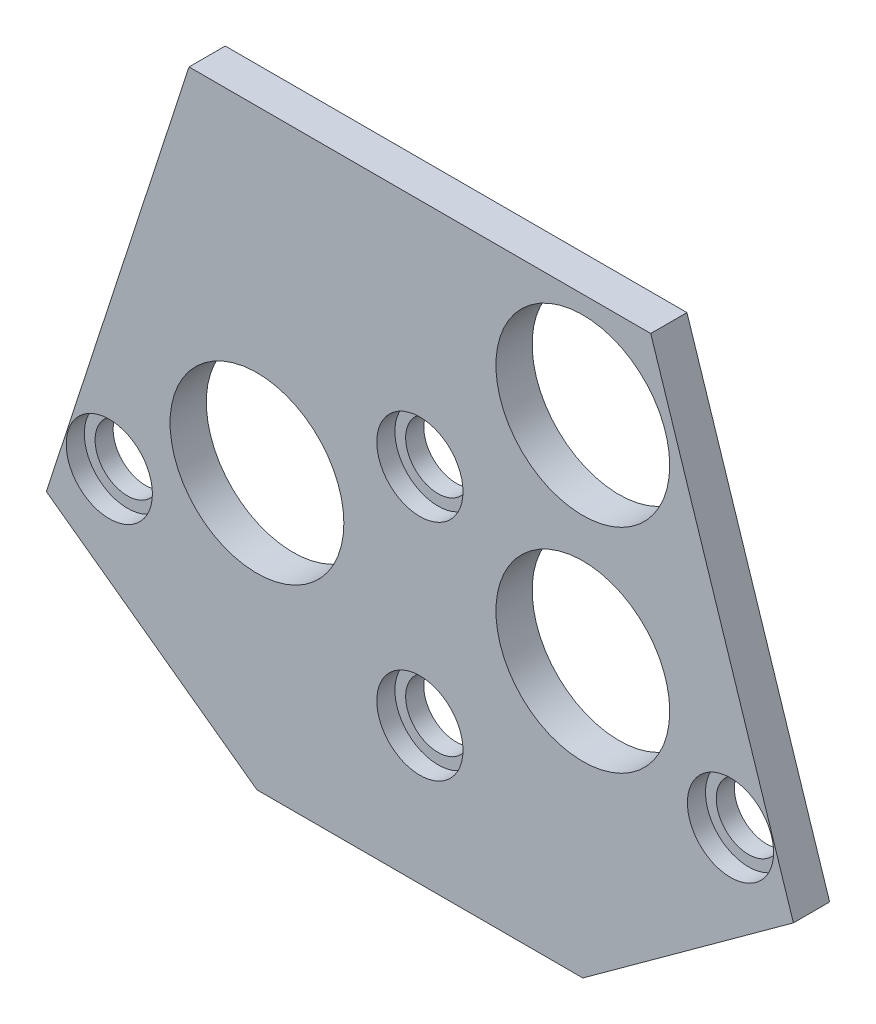
ISO-10303-21;
HEADER;
FILE_DESCRIPTION(('STEP AP214'),'2;1');
FILE_NAME('part.step','',(''),(''),'','','');
FILE_SCHEMA(('AUTOMOTIVE_DESIGN { 1 0 10303 214 1 1 1 1 }'));
ENDSEC;
DATA;
#1=APPLICATION_CONTEXT('core data for automotive mechanical design processes');
#2=APPLICATION_PROTOCOL_DEFINITION('international standard','automotive_design',2000,#1);
#3=PRODUCT_CONTEXT('',#1,'mechanical');
#4=PRODUCT('Part','Part','',(#3));
#5=PRODUCT_RELATED_PRODUCT_CATEGORY('part','',(#4));
#6=PRODUCT_DEFINITION_FORMATION('','',#4);
#7=PRODUCT_DEFINITION_CONTEXT('part definition',#1,'design');
#8=PRODUCT_DEFINITION('design','',#6,#7);
#9=PRODUCT_DEFINITION_SHAPE('','',#8);
#10=(LENGTH_UNIT() NAMED_UNIT(*) SI_UNIT(.MILLI.,.METRE.));
#11=(NAMED_UNIT(*) PLANE_ANGLE_UNIT() SI_UNIT($,.RADIAN.));
#12=(NAMED_UNIT(*) SI_UNIT($,.STERADIAN.) SOLID_ANGLE_UNIT());
#13=UNCERTAINTY_MEASURE_WITH_UNIT(LENGTH_MEASURE(1.E-05),#10,'distance_accuracy_value','');
#14=(GEOMETRIC_REPRESENTATION_CONTEXT(3) GLOBAL_UNCERTAINTY_ASSIGNED_CONTEXT((#13)) GLOBAL_UNIT_ASSIGNED_CONTEXT((#10,
#11,#12)) REPRESENTATION_CONTEXT('',''));
#15=CARTESIAN_POINT('',(0.,0.,0.));
#16=DIRECTION('',(0.,0.,1.));
#17=DIRECTION('',(1.,0.,0.));
#18=AXIS2_PLACEMENT_3D('',#15,#16,#17);
#19=CARTESIAN_POINT('',(0.,0.,5.334));
#20=DIRECTION('',(0.,0.,-1.));
#21=DIRECTION('',(-1.,0.,0.));
#22=AXIS2_PLACEMENT_3D('',#19,#20,#21);
#23=CYLINDRICAL_SURFACE('',#22,4.76250000000001);
#24=CARTESIAN_POINT('',(0.,0.,0.));
#25=DIRECTION('',(0.,0.,1.));
#26=DIRECTION('',(1.,0.,0.));
#27=AXIS2_PLACEMENT_3D('',#24,#25,#26);
#28=CIRCLE('',#27,4.76250000000001);
#29=CARTESIAN_POINT('',(4.76250000000001,0.,0.));
#30=VERTEX_POINT('',#29);
#31=EDGE_CURVE('E130',#30,#30,#28,.T.);
#32=ORIENTED_EDGE('',*,*,#31,.F.);
#33=EDGE_LOOP('',(#32));
#34=FACE_BOUND('',#33,.T.);
#35=CARTESIAN_POINT('',(0.,0.,2.667));
#36=DIRECTION('',(0.,0.,1.));
#37=DIRECTION('',(1.,0.,0.));
#38=AXIS2_PLACEMENT_3D('',#35,#36,#37);
#39=CIRCLE('',#38,4.7625);
#40=CARTESIAN_POINT('',(4.7625,0.,2.667));
#41=VERTEX_POINT('',#40);
#42=EDGE_CURVE('E277',#41,#41,#39,.T.);
#43=ORIENTED_EDGE('',*,*,#42,.T.);
#44=EDGE_LOOP('',(#43));
#45=FACE_BOUND('',#44,.T.);
#46=ADVANCED_FACE('F35',(#34,#45),#23,.F.);
#47=CARTESIAN_POINT('',(-50.4535452255246,16.3933505885501,5.334));
#48=DIRECTION('',(0.951056516295157,-0.309016994374938,0.));
#49=DIRECTION('',(0.309016994374938,0.951056516295157,0.));
#50=AXIS2_PLACEMENT_3D('',#47,#48,#49);
#51=PLANE('',#50);
#52=DIRECTION('',(-0.309016994374938,-0.951056516295157,0.));
#53=VECTOR('',#52,1.);
#54=CARTESIAN_POINT('',(-50.4535452255246,16.3933505885501,0.));
#55=LINE('',#54,#53);
#56=CARTESIAN_POINT('',(-34.0059481811678,67.0138492380612,0.));
#57=VERTEX_POINT('',#56);
#58=CARTESIAN_POINT('',(-55.0227799767962,2.33069201707196,0.));
#59=VERTEX_POINT('',#58);
#60=EDGE_CURVE('E133',#57,#59,#55,.T.);
#61=ORIENTED_EDGE('',*,*,#60,.T.);
#62=DIRECTION('',(0.,0.,-1.));
#63=VECTOR('',#62,1.);
#64=CARTESIAN_POINT('',(-55.0227799767962,2.33069201707196,5.334));
#65=LINE('',#64,#63);
#66=CARTESIAN_POINT('',(-55.0227799767962,2.33069201707196,5.334));
#67=VERTEX_POINT('',#66);
#68=EDGE_CURVE('E11',#67,#59,#65,.T.);
#69=ORIENTED_EDGE('',*,*,#68,.F.);
#70=DIRECTION('',(-0.309016994374938,-0.951056516295157,0.));
#71=VECTOR('',#70,1.);
#72=CARTESIAN_POINT('',(-50.4535452255246,16.3933505885501,5.334));
#73=LINE('',#72,#71);
#74=CARTESIAN_POINT('',(-34.0059481811678,67.0138492380612,5.334));
#75=VERTEX_POINT('',#74);
#76=EDGE_CURVE('E157',#75,#67,#73,.T.);
#77=ORIENTED_EDGE('',*,*,#76,.F.);
#78=DIRECTION('',(0.,0.,-1.));
#79=VECTOR('',#78,1.);
#80=CARTESIAN_POINT('',(-34.0059481811678,67.0138492380612,5.334));
#81=LINE('',#80,#79);
#82=EDGE_CURVE('E116',#75,#57,#81,.T.);
#83=ORIENTED_EDGE('',*,*,#82,.T.);
#84=EDGE_LOOP('',(#61,#69,#77,#83));
#85=FACE_BOUND('',#84,.T.);
#86=ADVANCED_FACE('F155',(#85),#51,.F.);
#87=CARTESIAN_POINT('',(-17.9015930279491,-24.6394289913025,5.334));
#88=DIRECTION('',(0.587785252292465,0.809016994374953,0.));
#89=DIRECTION('',(-0.809016994374953,0.587785252292465,0.));
#90=AXIS2_PLACEMENT_3D('',#87,#88,#89);
#91=PLANE('',#90);
#92=DIRECTION('',(0.809016994374953,-0.587785252292465,0.));
#93=VECTOR('',#92,1.);
#94=CARTESIAN_POINT('',(-17.9015930279491,-24.6394289913025,0.));
#95=LINE('',#94,#93);
#96=CARTESIAN_POINT('',(-24.,-20.2086769730233,0.));
#97=VERTEX_POINT('',#96);
#98=EDGE_CURVE('E136',#59,#97,#95,.T.);
#99=ORIENTED_EDGE('',*,*,#98,.T.);
#100=DIRECTION('',(0.,0.,-1.));
#101=VECTOR('',#100,1.);
#102=CARTESIAN_POINT('',(-24.,-20.2086769730233,5.334));
#103=LINE('',#102,#101);
#104=CARTESIAN_POINT('',(-24.,-20.2086769730233,5.334));
#105=VERTEX_POINT('',#104);
#106=EDGE_CURVE('E44',#105,#97,#103,.T.);
#107=ORIENTED_EDGE('',*,*,#106,.F.);
#108=DIRECTION('',(0.809016994374953,-0.587785252292465,0.));
#109=VECTOR('',#108,1.);
#110=CARTESIAN_POINT('',(-17.9015930279491,-24.6394289913025,5.334));
#111=LINE('',#110,#109);
#112=EDGE_CURVE('E89',#67,#105,#111,.T.);
#113=ORIENTED_EDGE('',*,*,#112,.F.);
#114=ORIENTED_EDGE('',*,*,#68,.T.);
#115=EDGE_LOOP('',(#99,#107,#113,#114));
#116=FACE_BOUND('',#115,.T.);
#117=ADVANCED_FACE('F177',(#116),#91,.F.);
#118=CARTESIAN_POINT('',(0.,-20.2086769730233,5.334));
#119=DIRECTION('',(0.,1.,0.));
#120=DIRECTION('',(0.,0.,1.));
#121=AXIS2_PLACEMENT_3D('',#118,#119,#120);
#122=PLANE('',#121);
#123=DIRECTION('',(1.,0.,0.));
#124=VECTOR('',#123,1.);
#125=CARTESIAN_POINT('',(0.,-20.2086769730233,0.));
#126=LINE('',#125,#124);
#127=CARTESIAN_POINT('',(24.,-20.2086769730233,0.));
#128=VERTEX_POINT('',#127);
#129=EDGE_CURVE('E138',#97,#128,#126,.T.);
#130=ORIENTED_EDGE('',*,*,#129,.T.);
#131=DIRECTION('',(0.,0.,-1.));
#132=VECTOR('',#131,1.);
#133=CARTESIAN_POINT('',(24.,-20.2086769730233,5.334));
#134=LINE('',#133,#132);
#135=CARTESIAN_POINT('',(24.,-20.2086769730233,5.334));
#136=VERTEX_POINT('',#135);
#137=EDGE_CURVE('E111',#136,#128,#134,.T.);
#138=ORIENTED_EDGE('',*,*,#137,.F.);
#139=DIRECTION('',(1.,0.,0.));
#140=VECTOR('',#139,1.);
#141=CARTESIAN_POINT('',(0.,-20.2086769730233,5.334));
#142=LINE('',#141,#140);
#143=EDGE_CURVE('E102',#105,#136,#142,.T.);
#144=ORIENTED_EDGE('',*,*,#143,.F.);
#145=ORIENTED_EDGE('',*,*,#106,.T.);
#146=EDGE_LOOP('',(#130,#138,#144,#145));
#147=FACE_BOUND('',#146,.T.);
#148=ADVANCED_FACE('F149',(#147),#122,.F.);
#149=CARTESIAN_POINT('',(17.9015930279497,-24.6394289913023,5.334));
#150=DIRECTION('',(-0.587785252292481,0.809016994374941,0.));
#151=DIRECTION('',(-0.809016994374941,-0.587785252292481,0.));
#152=AXIS2_PLACEMENT_3D('',#149,#150,#151);
#153=PLANE('',#152);
#154=DIRECTION('',(0.809016994374941,0.587785252292481,0.));
#155=VECTOR('',#154,1.);
#156=CARTESIAN_POINT('',(17.9015930279497,-24.6394289913023,0.));
#157=LINE('',#156,#155);
#158=CARTESIAN_POINT('',(55.0227799767966,2.33069201707308,0.));
#159=VERTEX_POINT('',#158);
#160=EDGE_CURVE('E110',#128,#159,#157,.T.);
#161=ORIENTED_EDGE('',*,*,#160,.T.);
#162=DIRECTION('',(0.,0.,-1.));
#163=VECTOR('',#162,1.);
#164=CARTESIAN_POINT('',(55.0227799767966,2.33069201707308,5.334));
#165=LINE('',#164,#163);
#166=CARTESIAN_POINT('',(55.0227799767966,2.33069201707308,5.334));
#167=VERTEX_POINT('',#166);
#168=EDGE_CURVE('E107',#167,#159,#165,.T.);
#169=ORIENTED_EDGE('',*,*,#168,.F.);
#170=DIRECTION('',(0.809016994374941,0.587785252292481,0.));
#171=VECTOR('',#170,1.);
#172=CARTESIAN_POINT('',(17.9015930279497,-24.6394289913023,5.334));
#173=LINE('',#172,#171);
#174=EDGE_CURVE('E96',#136,#167,#173,.T.);
#175=ORIENTED_EDGE('',*,*,#174,.F.);
#176=ORIENTED_EDGE('',*,*,#137,.T.);
#177=EDGE_LOOP('',(#161,#169,#175,#176));
#178=FACE_BOUND('',#177,.T.);
#179=ADVANCED_FACE('F108',(#178),#153,.F.);
#180=CARTESIAN_POINT('',(50.4535452255246,16.3933505885512,5.334));
#181=DIRECTION('',(-0.951056516295151,-0.309016994374957,0.));
#182=DIRECTION('',(0.309016994374957,-0.951056516295151,0.));
#183=AXIS2_PLACEMENT_3D('',#180,#181,#182);
#184=PLANE('',#183);
#185=DIRECTION('',(-0.309016994374957,0.951056516295151,0.));
#186=VECTOR('',#185,1.);
#187=CARTESIAN_POINT('',(50.4535452255246,16.3933505885512,0.));
#188=LINE('',#187,#186);
#189=CARTESIAN_POINT('',(34.0059481811668,67.0138492380619,0.));
#190=VERTEX_POINT('',#189);
#191=EDGE_CURVE('E75',#159,#190,#188,.T.);
#192=ORIENTED_EDGE('',*,*,#191,.T.);
#193=DIRECTION('',(0.,0.,-1.));
#194=VECTOR('',#193,1.);
#195=CARTESIAN_POINT('',(34.0059481811668,67.0138492380619,5.334));
#196=LINE('',#195,#194);
#197=CARTESIAN_POINT('',(34.0059481811668,67.0138492380619,5.334));
#198=VERTEX_POINT('',#197);
#199=EDGE_CURVE('E112',#198,#190,#196,.T.);
#200=ORIENTED_EDGE('',*,*,#199,.F.);
#201=DIRECTION('',(-0.309016994374957,0.951056516295151,0.));
#202=VECTOR('',#201,1.);
#203=CARTESIAN_POINT('',(50.4535452255246,16.3933505885512,5.334));
#204=LINE('',#203,#202);
#205=EDGE_CURVE('E100',#167,#198,#204,.T.);
#206=ORIENTED_EDGE('',*,*,#205,.F.);
#207=ORIENTED_EDGE('',*,*,#168,.T.);
#208=EDGE_LOOP('',(#192,#200,#206,#207));
#209=FACE_BOUND('',#208,.T.);
#210=ADVANCED_FACE('F114',(#209),#184,.F.);
#211=CARTESIAN_POINT('',(24.,20.2086769730232,5.334));
#212=DIRECTION('',(0.,0.,-1.));
#213=DIRECTION('',(-1.,0.,0.));
#214=AXIS2_PLACEMENT_3D('',#211,#212,#213);
#215=CYLINDRICAL_SURFACE('',#214,12.8);
#216=CARTESIAN_POINT('',(24.,20.2086769730232,5.334));
#217=DIRECTION('',(0.,0.,1.));
#218=DIRECTION('',(1.,0.,0.));
#219=AXIS2_PLACEMENT_3D('',#216,#217,#218);
#220=CIRCLE('',#219,12.8);
#221=CARTESIAN_POINT('',(36.8,20.2086769730232,5.334));
#222=VERTEX_POINT('',#221);
#223=EDGE_CURVE('E302',#222,#222,#220,.T.);
#224=ORIENTED_EDGE('',*,*,#223,.T.);
#225=EDGE_LOOP('',(#224));
#226=FACE_BOUND('',#225,.T.);
#227=CARTESIAN_POINT('',(24.,20.2086769730232,0.));
#228=DIRECTION('',(0.,0.,1.));
#229=DIRECTION('',(1.,0.,0.));
#230=AXIS2_PLACEMENT_3D('',#227,#228,#229);
#231=CIRCLE('',#230,12.8);
#232=CARTESIAN_POINT('',(36.8,20.2086769730232,0.));
#233=VERTEX_POINT('',#232);
#234=EDGE_CURVE('E127',#233,#233,#231,.T.);
#235=ORIENTED_EDGE('',*,*,#234,.F.);
#236=EDGE_LOOP('',(#235));
#237=FACE_BOUND('',#236,.T.);
#238=ADVANCED_FACE('F183',(#226,#237),#215,.F.);
#239=CARTESIAN_POINT('',(-24.,20.2086769730232,5.334));
#240=DIRECTION('',(0.,0.,-1.));
#241=DIRECTION('',(-1.,0.,0.));
#242=AXIS2_PLACEMENT_3D('',#239,#240,#241);
#243=CYLINDRICAL_SURFACE('',#242,12.8);
#244=CARTESIAN_POINT('',(-24.,20.2086769730232,5.334));
#245=DIRECTION('',(0.,0.,1.));
#246=DIRECTION('',(1.,0.,0.));
#247=AXIS2_PLACEMENT_3D('',#244,#245,#246);
#248=CIRCLE('',#247,12.8);
#249=CARTESIAN_POINT('',(-11.2,20.2086769730232,5.334));
#250=VERTEX_POINT('',#249);
#251=EDGE_CURVE('E193',#250,#250,#248,.T.);
#252=ORIENTED_EDGE('',*,*,#251,.T.);
#253=EDGE_LOOP('',(#252));
#254=FACE_BOUND('',#253,.T.);
#255=CARTESIAN_POINT('',(-24.,20.2086769730232,0.));
#256=DIRECTION('',(0.,0.,1.));
#257=DIRECTION('',(1.,0.,0.));
#258=AXIS2_PLACEMENT_3D('',#255,#256,#257);
#259=CIRCLE('',#258,12.8);
#260=CARTESIAN_POINT('',(-11.2,20.2086769730232,0.));
#261=VERTEX_POINT('',#260);
#262=EDGE_CURVE('E123',#261,#261,#259,.T.);
#263=ORIENTED_EDGE('',*,*,#262,.F.);
#264=EDGE_LOOP('',(#263));
#265=FACE_BOUND('',#264,.T.);
#266=ADVANCED_FACE('F167',(#254,#265),#243,.F.);
#267=CARTESIAN_POINT('',(24.,51.5836769730232,5.334));
#268=DIRECTION('',(0.,0.,-1.));
#269=DIRECTION('',(-1.,0.,0.));
#270=AXIS2_PLACEMENT_3D('',#267,#268,#269);
#271=CYLINDRICAL_SURFACE('',#270,12.8);
#272=CARTESIAN_POINT('',(24.,51.5836769730232,5.334));
#273=DIRECTION('',(0.,0.,1.));
#274=DIRECTION('',(1.,0.,0.));
#275=AXIS2_PLACEMENT_3D('',#272,#273,#274);
#276=CIRCLE('',#275,12.8);
#277=CARTESIAN_POINT('',(36.8,51.5836769730232,5.334));
#278=VERTEX_POINT('',#277);
#279=EDGE_CURVE('E143',#278,#278,#276,.T.);
#280=ORIENTED_EDGE('',*,*,#279,.T.);
#281=EDGE_LOOP('',(#280));
#282=FACE_BOUND('',#281,.T.);
#283=CARTESIAN_POINT('',(24.,51.5836769730232,0.));
#284=DIRECTION('',(0.,0.,1.));
#285=DIRECTION('',(1.,0.,0.));
#286=AXIS2_PLACEMENT_3D('',#283,#284,#285);
#287=CIRCLE('',#286,12.8);
#288=CARTESIAN_POINT('',(36.8,51.5836769730232,0.));
#289=VERTEX_POINT('',#288);
#290=EDGE_CURVE('E120',#289,#289,#287,.T.);
#291=ORIENTED_EDGE('',*,*,#290,.F.);
#292=EDGE_LOOP('',(#291));
#293=FACE_BOUND('',#292,.T.);
#294=ADVANCED_FACE('F37',(#282,#293),#271,.F.);
#295=CARTESIAN_POINT('',(-6.97380980567866E-13,67.0138492380615,5.334));
#296=DIRECTION('',(0.,-1.,0.));
#297=DIRECTION('',(1.,0.,0.));
#298=AXIS2_PLACEMENT_3D('',#295,#296,#297);
#299=PLANE('',#298);
#300=DIRECTION('',(-1.,0.,0.));
#301=VECTOR('',#300,1.);
#302=CARTESIAN_POINT('',(-6.97380980567866E-13,67.0138492380615,0.));
#303=LINE('',#302,#301);
#304=EDGE_CURVE('E81',#190,#57,#303,.T.);
#305=ORIENTED_EDGE('',*,*,#304,.T.);
#306=ORIENTED_EDGE('',*,*,#82,.F.);
#307=DIRECTION('',(-1.,0.,0.));
#308=VECTOR('',#307,1.);
#309=CARTESIAN_POINT('',(-6.97380980567866E-13,67.0138492380615,5.334));
#310=LINE('',#309,#308);
#311=EDGE_CURVE('E52',#198,#75,#310,.T.);
#312=ORIENTED_EDGE('',*,*,#311,.F.);
#313=ORIENTED_EDGE('',*,*,#199,.T.);
#314=EDGE_LOOP('',(#305,#306,#312,#313));
#315=FACE_BOUND('',#314,.T.);
#316=ADVANCED_FACE('F158',(#315),#299,.F.);
#317=CARTESIAN_POINT('',(0.,0.,5.334));
#318=DIRECTION('',(0.,0.,1.));
#319=DIRECTION('',(1.,0.,0.));
#320=AXIS2_PLACEMENT_3D('',#317,#318,#319);
#321=PLANE('',#320);
#322=CARTESIAN_POINT('',(-45.7516796693192,9.84884506070272,5.334));
#323=DIRECTION('',(0.,0.,1.));
#324=DIRECTION('',(1.,0.,0.));
#325=AXIS2_PLACEMENT_3D('',#322,#323,#324);
#326=CIRCLE('',#325,6.35);
#327=CARTESIAN_POINT('',(-39.4016796693192,9.84884506070272,5.334));
#328=VERTEX_POINT('',#327);
#329=EDGE_CURVE('E273',#328,#328,#326,.T.);
#330=ORIENTED_EDGE('',*,*,#329,.F.);
#331=EDGE_LOOP('',(#330));
#332=FACE_BOUND('',#331,.T.);
#333=CARTESIAN_POINT('',(0.,33.0086769730232,5.334));
#334=DIRECTION('',(0.,0.,1.));
#335=DIRECTION('',(1.,0.,0.));
#336=AXIS2_PLACEMENT_3D('',#333,#334,#335);
#337=CIRCLE('',#336,6.35);
#338=CARTESIAN_POINT('',(6.35,33.0086769730232,5.334));
#339=VERTEX_POINT('',#338);
#340=EDGE_CURVE('E284',#339,#339,#337,.T.);
#341=ORIENTED_EDGE('',*,*,#340,.F.);
#342=EDGE_LOOP('',(#341));
#343=FACE_BOUND('',#342,.T.);
#344=CARTESIAN_POINT('',(45.7516796693194,9.84884506070348,5.334));
#345=DIRECTION('',(0.,0.,1.));
#346=DIRECTION('',(1.,0.,0.));
#347=AXIS2_PLACEMENT_3D('',#344,#345,#346);
#348=CIRCLE('',#347,6.35);
#349=CARTESIAN_POINT('',(52.1016796693194,9.84884506070348,5.334));
#350=VERTEX_POINT('',#349);
#351=EDGE_CURVE('E278',#350,#350,#348,.T.);
#352=ORIENTED_EDGE('',*,*,#351,.F.);
#353=EDGE_LOOP('',(#352));
#354=FACE_BOUND('',#353,.T.);
#355=CARTESIAN_POINT('',(0.,0.,5.334));
#356=DIRECTION('',(0.,0.,1.));
#357=DIRECTION('',(1.,0.,0.));
#358=AXIS2_PLACEMENT_3D('',#355,#356,#357);
#359=CIRCLE('',#358,6.35);
#360=CARTESIAN_POINT('',(6.35,0.,5.334));
#361=VERTEX_POINT('',#360);
#362=EDGE_CURVE('E294',#361,#361,#359,.T.);
#363=ORIENTED_EDGE('',*,*,#362,.F.);
#364=EDGE_LOOP('',(#363));
#365=FACE_BOUND('',#364,.T.);
#366=ORIENTED_EDGE('',*,*,#279,.F.);
#367=EDGE_LOOP('',(#366));
#368=FACE_BOUND('',#367,.T.);
#369=ORIENTED_EDGE('',*,*,#251,.F.);
#370=EDGE_LOOP('',(#369));
#371=FACE_BOUND('',#370,.T.);
#372=ORIENTED_EDGE('',*,*,#223,.F.);
#373=EDGE_LOOP('',(#372));
#374=FACE_BOUND('',#373,.T.);
#375=ORIENTED_EDGE('',*,*,#76,.T.);
#376=ORIENTED_EDGE('',*,*,#112,.T.);
#377=ORIENTED_EDGE('',*,*,#143,.T.);
#378=ORIENTED_EDGE('',*,*,#174,.T.);
#379=ORIENTED_EDGE('',*,*,#205,.T.);
#380=ORIENTED_EDGE('',*,*,#311,.T.);
#381=EDGE_LOOP('',(#375,#376,#377,#378,#379,#380));
#382=FACE_BOUND('',#381,.T.);
#383=ADVANCED_FACE('F98',(#332,#343,#354,#365,#368,#371,#374,#382),#321,.T.);
#384=CARTESIAN_POINT('',(0.,0.,0.));
#385=DIRECTION('',(0.,0.,1.));
#386=DIRECTION('',(1.,0.,0.));
#387=AXIS2_PLACEMENT_3D('',#384,#385,#386);
#388=PLANE('',#387);
#389=CARTESIAN_POINT('',(-45.7516796693192,9.84884506070272,0.));
#390=DIRECTION('',(0.,0.,1.));
#391=DIRECTION('',(1.,0.,0.));
#392=AXIS2_PLACEMENT_3D('',#389,#390,#391);
#393=CIRCLE('',#392,4.7625);
#394=CARTESIAN_POINT('',(-40.9891796693192,9.84884506070272,0.));
#395=VERTEX_POINT('',#394);
#396=EDGE_CURVE('E257',#395,#395,#393,.T.);
#397=ORIENTED_EDGE('',*,*,#396,.T.);
#398=EDGE_LOOP('',(#397));
#399=FACE_BOUND('',#398,.T.);
#400=CARTESIAN_POINT('',(0.,33.0086769730232,0.));
#401=DIRECTION('',(0.,0.,1.));
#402=DIRECTION('',(1.,0.,0.));
#403=AXIS2_PLACEMENT_3D('',#400,#401,#402);
#404=CIRCLE('',#403,4.76250000000001);
#405=CARTESIAN_POINT('',(4.7625,33.0086769730232,0.));
#406=VERTEX_POINT('',#405);
#407=EDGE_CURVE('E258',#406,#406,#404,.T.);
#408=ORIENTED_EDGE('',*,*,#407,.T.);
#409=EDGE_LOOP('',(#408));
#410=FACE_BOUND('',#409,.T.);
#411=CARTESIAN_POINT('',(45.7516796693194,9.84884506070348,0.));
#412=DIRECTION('',(0.,0.,1.));
#413=DIRECTION('',(1.,0.,0.));
#414=AXIS2_PLACEMENT_3D('',#411,#412,#413);
#415=CIRCLE('',#414,4.7625);
#416=CARTESIAN_POINT('',(50.5141796693194,9.84884506070348,0.));
#417=VERTEX_POINT('',#416);
#418=EDGE_CURVE('E263',#417,#417,#415,.T.);
#419=ORIENTED_EDGE('',*,*,#418,.T.);
#420=EDGE_LOOP('',(#419));
#421=FACE_BOUND('',#420,.T.);
#422=ORIENTED_EDGE('',*,*,#290,.T.);
#423=EDGE_LOOP('',(#422));
#424=FACE_BOUND('',#423,.T.);
#425=ORIENTED_EDGE('',*,*,#262,.T.);
#426=EDGE_LOOP('',(#425));
#427=FACE_BOUND('',#426,.T.);
#428=ORIENTED_EDGE('',*,*,#234,.T.);
#429=EDGE_LOOP('',(#428));
#430=FACE_BOUND('',#429,.T.);
#431=ORIENTED_EDGE('',*,*,#31,.T.);
#432=EDGE_LOOP('',(#431));
#433=FACE_BOUND('',#432,.T.);
#434=ORIENTED_EDGE('',*,*,#60,.F.);
#435=ORIENTED_EDGE('',*,*,#304,.F.);
#436=ORIENTED_EDGE('',*,*,#191,.F.);
#437=ORIENTED_EDGE('',*,*,#160,.F.);
#438=ORIENTED_EDGE('',*,*,#129,.F.);
#439=ORIENTED_EDGE('',*,*,#98,.F.);
#440=EDGE_LOOP('',(#434,#435,#436,#437,#438,#439));
#441=FACE_BOUND('',#440,.T.);
#442=ADVANCED_FACE('F152',(#399,#410,#421,#424,#427,#430,#433,#441),#388,.F.);
#443=CARTESIAN_POINT('',(0.,0.,2.667));
#444=DIRECTION('',(0.,0.,1.));
#445=DIRECTION('',(1.,0.,0.));
#446=AXIS2_PLACEMENT_3D('',#443,#444,#445);
#447=CYLINDRICAL_SURFACE('',#446,6.35);
#448=CARTESIAN_POINT('',(0.,0.,2.667));
#449=DIRECTION('',(0.,0.,1.));
#450=DIRECTION('',(1.,0.,0.));
#451=AXIS2_PLACEMENT_3D('',#448,#449,#450);
#452=CIRCLE('',#451,6.35);
#453=CARTESIAN_POINT('',(6.35,0.,2.667));
#454=VERTEX_POINT('',#453);
#455=EDGE_CURVE('E124',#454,#454,#452,.T.);
#456=ORIENTED_EDGE('',*,*,#455,.F.);
#457=EDGE_LOOP('',(#456));
#458=FACE_BOUND('',#457,.T.);
#459=ORIENTED_EDGE('',*,*,#362,.T.);
#460=EDGE_LOOP('',(#459));
#461=FACE_BOUND('',#460,.T.);
#462=ADVANCED_FACE('F198',(#458,#461),#447,.F.);
#463=CARTESIAN_POINT('',(0.,0.,2.667));
#464=DIRECTION('',(0.,0.,1.));
#465=DIRECTION('',(1.,0.,0.));
#466=AXIS2_PLACEMENT_3D('',#463,#464,#465);
#467=PLANE('',#466);
#468=ORIENTED_EDGE('',*,*,#42,.F.);
#469=EDGE_LOOP('',(#468));
#470=FACE_BOUND('',#469,.T.);
#471=ORIENTED_EDGE('',*,*,#455,.T.);
#472=EDGE_LOOP('',(#471));
#473=FACE_BOUND('',#472,.T.);
#474=ADVANCED_FACE('F206',(#470,#473),#467,.T.);
#475=CARTESIAN_POINT('',(45.7516796693194,9.84884506070348,2.667));
#476=DIRECTION('',(0.,0.,1.));
#477=DIRECTION('',(1.,0.,0.));
#478=AXIS2_PLACEMENT_3D('',#475,#476,#477);
#479=CYLINDRICAL_SURFACE('',#478,6.35);
#480=CARTESIAN_POINT('',(45.7516796693194,9.84884506070348,2.667));
#481=DIRECTION('',(0.,0.,1.));
#482=DIRECTION('',(1.,0.,0.));
#483=AXIS2_PLACEMENT_3D('',#480,#481,#482);
#484=CIRCLE('',#483,6.35);
#485=CARTESIAN_POINT('',(52.1016796693194,9.84884506070348,2.667));
#486=VERTEX_POINT('',#485);
#487=EDGE_CURVE('E274',#486,#486,#484,.T.);
#488=ORIENTED_EDGE('',*,*,#487,.F.);
#489=EDGE_LOOP('',(#488));
#490=FACE_BOUND('',#489,.T.);
#491=ORIENTED_EDGE('',*,*,#351,.T.);
#492=EDGE_LOOP('',(#491));
#493=FACE_BOUND('',#492,.T.);
#494=ADVANCED_FACE('F214',(#490,#493),#479,.F.);
#495=CARTESIAN_POINT('',(45.7516796693194,9.84884506070348,2.667));
#496=DIRECTION('',(0.,0.,1.));
#497=DIRECTION('',(1.,0.,0.));
#498=AXIS2_PLACEMENT_3D('',#495,#496,#497);
#499=PLANE('',#498);
#500=CARTESIAN_POINT('',(45.7516796693194,9.84884506070348,2.667));
#501=DIRECTION('',(0.,0.,1.));
#502=DIRECTION('',(1.,0.,0.));
#503=AXIS2_PLACEMENT_3D('',#500,#501,#502);
#504=CIRCLE('',#503,4.7625);
#505=CARTESIAN_POINT('',(50.5141796693194,9.84884506070348,2.667));
#506=VERTEX_POINT('',#505);
#507=EDGE_CURVE('E270',#506,#506,#504,.T.);
#508=ORIENTED_EDGE('',*,*,#507,.F.);
#509=EDGE_LOOP('',(#508));
#510=FACE_BOUND('',#509,.T.);
#511=ORIENTED_EDGE('',*,*,#487,.T.);
#512=EDGE_LOOP('',(#511));
#513=FACE_BOUND('',#512,.T.);
#514=ADVANCED_FACE('F229',(#510,#513),#499,.T.);
#515=CARTESIAN_POINT('',(0.,33.0086769730232,2.667));
#516=DIRECTION('',(0.,0.,1.));
#517=DIRECTION('',(1.,0.,0.));
#518=AXIS2_PLACEMENT_3D('',#515,#516,#517);
#519=CYLINDRICAL_SURFACE('',#518,6.35);
#520=CARTESIAN_POINT('',(0.,33.0086769730232,2.667));
#521=DIRECTION('',(0.,0.,1.));
#522=DIRECTION('',(1.,0.,0.));
#523=AXIS2_PLACEMENT_3D('',#520,#521,#522);
#524=CIRCLE('',#523,6.35);
#525=CARTESIAN_POINT('',(6.35,33.0086769730232,2.667));
#526=VERTEX_POINT('',#525);
#527=EDGE_CURVE('E281',#526,#526,#524,.T.);
#528=ORIENTED_EDGE('',*,*,#527,.F.);
#529=EDGE_LOOP('',(#528));
#530=FACE_BOUND('',#529,.T.);
#531=ORIENTED_EDGE('',*,*,#340,.T.);
#532=EDGE_LOOP('',(#531));
#533=FACE_BOUND('',#532,.T.);
#534=ADVANCED_FACE('F226',(#530,#533),#519,.F.);
#535=CARTESIAN_POINT('',(0.,33.0086769730232,2.667));
#536=DIRECTION('',(0.,0.,1.));
#537=DIRECTION('',(1.,0.,0.));
#538=AXIS2_PLACEMENT_3D('',#535,#536,#537);
#539=PLANE('',#538);
#540=CARTESIAN_POINT('',(0.,33.0086769730232,2.667));
#541=DIRECTION('',(0.,0.,1.));
#542=DIRECTION('',(1.,0.,0.));
#543=AXIS2_PLACEMENT_3D('',#540,#541,#542);
#544=CIRCLE('',#543,4.76250000000001);
#545=CARTESIAN_POINT('',(4.7625,33.0086769730232,2.667));
#546=VERTEX_POINT('',#545);
#547=EDGE_CURVE('E260',#546,#546,#544,.T.);
#548=ORIENTED_EDGE('',*,*,#547,.F.);
#549=EDGE_LOOP('',(#548));
#550=FACE_BOUND('',#549,.T.);
#551=ORIENTED_EDGE('',*,*,#527,.T.);
#552=EDGE_LOOP('',(#551));
#553=FACE_BOUND('',#552,.T.);
#554=ADVANCED_FACE('F220',(#550,#553),#539,.T.);
#555=CARTESIAN_POINT('',(-45.7516796693192,9.84884506070272,2.667));
#556=DIRECTION('',(0.,0.,1.));
#557=DIRECTION('',(1.,0.,0.));
#558=AXIS2_PLACEMENT_3D('',#555,#556,#557);
#559=CYLINDRICAL_SURFACE('',#558,6.35);
#560=CARTESIAN_POINT('',(-45.7516796693192,9.84884506070272,2.667));
#561=DIRECTION('',(0.,0.,1.));
#562=DIRECTION('',(1.,0.,0.));
#563=AXIS2_PLACEMENT_3D('',#560,#561,#562);
#564=CIRCLE('',#563,6.35);
#565=CARTESIAN_POINT('',(-39.4016796693192,9.84884506070272,2.667));
#566=VERTEX_POINT('',#565);
#567=EDGE_CURVE('E287',#566,#566,#564,.T.);
#568=ORIENTED_EDGE('',*,*,#567,.F.);
#569=EDGE_LOOP('',(#568));
#570=FACE_BOUND('',#569,.T.);
#571=ORIENTED_EDGE('',*,*,#329,.T.);
#572=EDGE_LOOP('',(#571));
#573=FACE_BOUND('',#572,.T.);
#574=ADVANCED_FACE('F216',(#570,#573),#559,.F.);
#575=CARTESIAN_POINT('',(-45.7516796693192,9.84884506070272,2.667));
#576=DIRECTION('',(0.,0.,1.));
#577=DIRECTION('',(1.,0.,0.));
#578=AXIS2_PLACEMENT_3D('',#575,#576,#577);
#579=PLANE('',#578);
#580=CARTESIAN_POINT('',(-45.7516796693192,9.84884506070272,2.667));
#581=DIRECTION('',(0.,0.,1.));
#582=DIRECTION('',(1.,0.,0.));
#583=AXIS2_PLACEMENT_3D('',#580,#581,#582);
#584=CIRCLE('',#583,4.7625);
#585=CARTESIAN_POINT('',(-40.9891796693192,9.84884506070272,2.667));
#586=VERTEX_POINT('',#585);
#587=EDGE_CURVE('E255',#586,#586,#584,.T.);
#588=ORIENTED_EDGE('',*,*,#587,.F.);
#589=EDGE_LOOP('',(#588));
#590=FACE_BOUND('',#589,.T.);
#591=ORIENTED_EDGE('',*,*,#567,.T.);
#592=EDGE_LOOP('',(#591));
#593=FACE_BOUND('',#592,.T.);
#594=ADVANCED_FACE('F219',(#590,#593),#579,.T.);
#595=CARTESIAN_POINT('',(-45.7516796693192,9.84884506070272,0.));
#596=DIRECTION('',(0.,0.,1.));
#597=DIRECTION('',(1.,0.,0.));
#598=AXIS2_PLACEMENT_3D('',#595,#596,#597);
#599=CYLINDRICAL_SURFACE('',#598,4.7625);
#600=ORIENTED_EDGE('',*,*,#587,.T.);
#601=EDGE_LOOP('',(#600));
#602=FACE_BOUND('',#601,.T.);
#603=ORIENTED_EDGE('',*,*,#396,.F.);
#604=EDGE_LOOP('',(#603));
#605=FACE_BOUND('',#604,.T.);
#606=ADVANCED_FACE('F224',(#602,#605),#599,.F.);
#607=CARTESIAN_POINT('',(0.,33.0086769730232,0.));
#608=DIRECTION('',(0.,0.,1.));
#609=DIRECTION('',(1.,0.,0.));
#610=AXIS2_PLACEMENT_3D('',#607,#608,#609);
#611=CYLINDRICAL_SURFACE('',#610,4.76250000000001);
#612=ORIENTED_EDGE('',*,*,#547,.T.);
#613=EDGE_LOOP('',(#612));
#614=FACE_BOUND('',#613,.T.);
#615=ORIENTED_EDGE('',*,*,#407,.F.);
#616=EDGE_LOOP('',(#615));
#617=FACE_BOUND('',#616,.T.);
#618=ADVANCED_FACE('F243',(#614,#617),#611,.F.);
#619=CARTESIAN_POINT('',(45.7516796693194,9.84884506070348,0.));
#620=DIRECTION('',(0.,0.,1.));
#621=DIRECTION('',(1.,0.,0.));
#622=AXIS2_PLACEMENT_3D('',#619,#620,#621);
#623=CYLINDRICAL_SURFACE('',#622,4.7625);
#624=ORIENTED_EDGE('',*,*,#507,.T.);
#625=EDGE_LOOP('',(#624));
#626=FACE_BOUND('',#625,.T.);
#627=ORIENTED_EDGE('',*,*,#418,.F.);
#628=EDGE_LOOP('',(#627));
#629=FACE_BOUND('',#628,.T.);
#630=ADVANCED_FACE('F240',(#626,#629),#623,.F.);
#631=CLOSED_SHELL('',(#46,#86,#117,#148,#179,#210,#238,#266,#294,#316,#383,#442,#462,#474,#494,
#514,#534,#554,#574,#594,#606,#618,#630));
#632=MANIFOLD_SOLID_BREP('B2',#631);
#633=ADVANCED_BREP_SHAPE_REPRESENTATION('',(#18,#632),#14);
#634=SHAPE_DEFINITION_REPRESENTATION(#9,#633);
ENDSEC;
END-ISO-10303-21;
